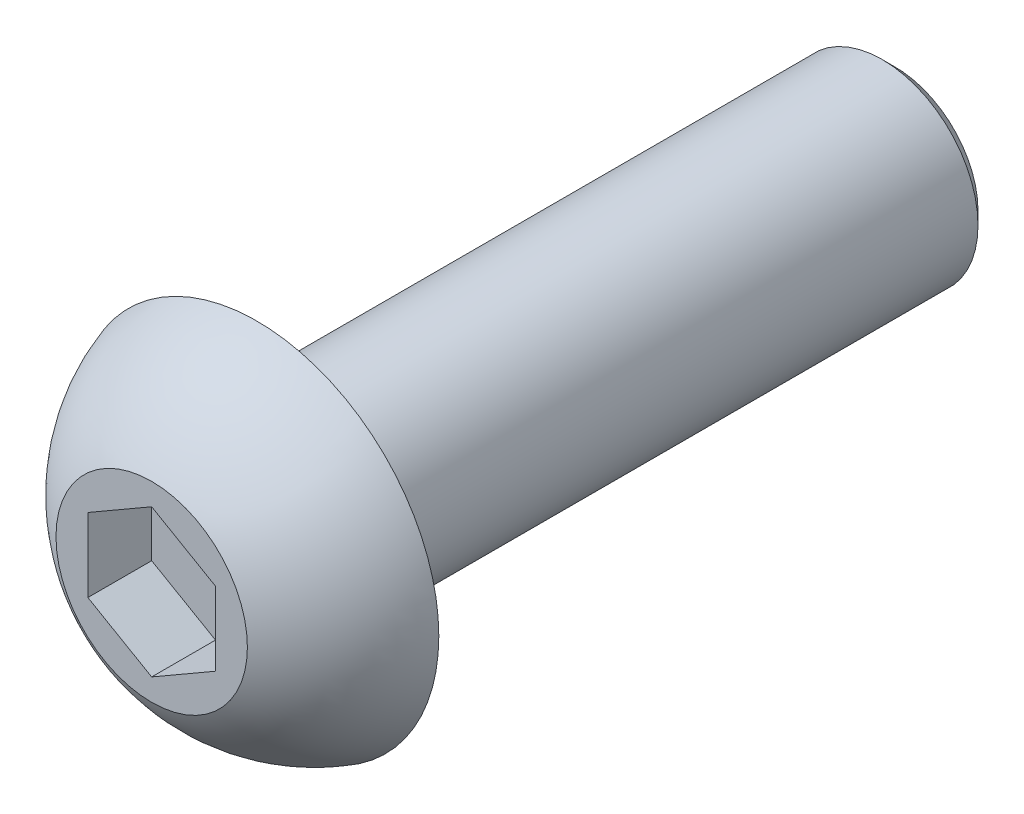
ISO-10303-21;
HEADER;
FILE_DESCRIPTION(('STEP AP214'),'2;1');
FILE_NAME('part.step','',(''),(''),'','','');
FILE_SCHEMA(('AUTOMOTIVE_DESIGN { 1 0 10303 214 1 1 1 1 }'));
ENDSEC;
DATA;
#1=APPLICATION_CONTEXT('core data for automotive mechanical design processes');
#2=APPLICATION_PROTOCOL_DEFINITION('international standard','automotive_design',2000,#1);
#3=PRODUCT_CONTEXT('',#1,'mechanical');
#4=PRODUCT('Part','Part','',(#3));
#5=PRODUCT_RELATED_PRODUCT_CATEGORY('part','',(#4));
#6=PRODUCT_DEFINITION_FORMATION('','',#4);
#7=PRODUCT_DEFINITION_CONTEXT('part definition',#1,'design');
#8=PRODUCT_DEFINITION('design','',#6,#7);
#9=PRODUCT_DEFINITION_SHAPE('','',#8);
#10=(LENGTH_UNIT() NAMED_UNIT(*) SI_UNIT(.MILLI.,.METRE.));
#11=(NAMED_UNIT(*) PLANE_ANGLE_UNIT() SI_UNIT($,.RADIAN.));
#12=(NAMED_UNIT(*) SI_UNIT($,.STERADIAN.) SOLID_ANGLE_UNIT());
#13=UNCERTAINTY_MEASURE_WITH_UNIT(LENGTH_MEASURE(1.E-05),#10,'distance_accuracy_value','');
#14=(GEOMETRIC_REPRESENTATION_CONTEXT(3) GLOBAL_UNCERTAINTY_ASSIGNED_CONTEXT((#13)) GLOBAL_UNIT_ASSIGNED_CONTEXT((#10,
#11,#12)) REPRESENTATION_CONTEXT('',''));
#15=CARTESIAN_POINT('',(0.,0.,0.));
#16=DIRECTION('',(0.,0.,1.));
#17=DIRECTION('',(1.,0.,0.));
#18=AXIS2_PLACEMENT_3D('',#15,#16,#17);
#19=CARTESIAN_POINT('',(0.,0.,-0.848743432909573));
#20=DIRECTION('',(0.,0.,1.));
#21=DIRECTION('',(1.,0.,0.));
#22=AXIS2_PLACEMENT_3D('',#19,#20,#21);
#23=DEGENERATE_TOROIDAL_SURFACE('',#22,0.129313581999413,2.85,.T.);
#24=CARTESIAN_POINT('',(0.,0.,1.65));
#25=DIRECTION('',(0.,0.,1.));
#26=DIRECTION('',(1.,0.,0.));
#27=AXIS2_PLACEMENT_3D('',#24,#25,#26);
#28=CIRCLE('',#27,1.5);
#29=CARTESIAN_POINT('',(1.5,0.,1.65));
#30=VERTEX_POINT('',#29);
#31=EDGE_CURVE('E147',#30,#30,#28,.T.);
#32=ORIENTED_EDGE('',*,*,#31,.F.);
#33=EDGE_LOOP('',(#32));
#34=FACE_BOUND('',#33,.T.);
#35=CARTESIAN_POINT('',(0.,0.,0.));
#36=DIRECTION('',(0.,0.,1.));
#37=DIRECTION('',(1.,0.,0.));
#38=AXIS2_PLACEMENT_3D('',#35,#36,#37);
#39=CIRCLE('',#38,2.85);
#40=CARTESIAN_POINT('',(2.85,0.,0.));
#41=VERTEX_POINT('',#40);
#42=EDGE_CURVE('E136',#41,#41,#39,.T.);
#43=ORIENTED_EDGE('',*,*,#42,.T.);
#44=EDGE_LOOP('',(#43));
#45=FACE_BOUND('',#44,.T.);
#46=ADVANCED_FACE('F34',(#34,#45),#23,.T.);
#47=CARTESIAN_POINT('',(0.,0.,1.65));
#48=DIRECTION('',(0.,0.,-1.));
#49=DIRECTION('',(-1.,0.,0.));
#50=AXIS2_PLACEMENT_3D('',#47,#48,#49);
#51=PLANE('',#50);
#52=DIRECTION('',(-0.866025403784439,-0.5,0.));
#53=VECTOR('',#52,1.);
#54=CARTESIAN_POINT('',(0.,1.15470053837925,1.65));
#55=LINE('',#54,#53);
#56=CARTESIAN_POINT('',(0.,1.15470053837925,1.65));
#57=VERTEX_POINT('',#56);
#58=CARTESIAN_POINT('',(-1.,0.577350269189626,1.65));
#59=VERTEX_POINT('',#58);
#60=EDGE_CURVE('E123',#57,#59,#55,.T.);
#61=ORIENTED_EDGE('',*,*,#60,.F.);
#62=DIRECTION('',(-0.866025403784439,0.5,0.));
#63=VECTOR('',#62,1.);
#64=CARTESIAN_POINT('',(1.,0.577350269189626,1.65));
#65=LINE('',#64,#63);
#66=CARTESIAN_POINT('',(1.,0.577350269189626,1.65));
#67=VERTEX_POINT('',#66);
#68=EDGE_CURVE('E49',#67,#57,#65,.T.);
#69=ORIENTED_EDGE('',*,*,#68,.F.);
#70=DIRECTION('',(0.,1.,0.));
#71=VECTOR('',#70,1.);
#72=CARTESIAN_POINT('',(1.,-0.577350269189626,1.65));
#73=LINE('',#72,#71);
#74=CARTESIAN_POINT('',(1.,-0.577350269189626,1.65));
#75=VERTEX_POINT('',#74);
#76=EDGE_CURVE('E132',#75,#67,#73,.T.);
#77=ORIENTED_EDGE('',*,*,#76,.F.);
#78=DIRECTION('',(0.866025403784439,0.5,0.));
#79=VECTOR('',#78,1.);
#80=CARTESIAN_POINT('',(0.,-1.15470053837925,1.65));
#81=LINE('',#80,#79);
#82=CARTESIAN_POINT('',(0.,-1.15470053837925,1.65));
#83=VERTEX_POINT('',#82);
#84=EDGE_CURVE('E130',#83,#75,#81,.T.);
#85=ORIENTED_EDGE('',*,*,#84,.F.);
#86=DIRECTION('',(0.866025403784439,-0.5,0.));
#87=VECTOR('',#86,1.);
#88=CARTESIAN_POINT('',(-1.,-0.577350269189626,1.65));
#89=LINE('',#88,#87);
#90=CARTESIAN_POINT('',(-1.,-0.577350269189626,1.65));
#91=VERTEX_POINT('',#90);
#92=EDGE_CURVE('E97',#91,#83,#89,.T.);
#93=ORIENTED_EDGE('',*,*,#92,.F.);
#94=DIRECTION('',(0.,-1.,0.));
#95=VECTOR('',#94,1.);
#96=CARTESIAN_POINT('',(-1.,0.577350269189626,1.65));
#97=LINE('',#96,#95);
#98=EDGE_CURVE('E126',#59,#91,#97,.T.);
#99=ORIENTED_EDGE('',*,*,#98,.F.);
#100=EDGE_LOOP('',(#61,#69,#77,#85,#93,#99));
#101=FACE_BOUND('',#100,.T.);
#102=ORIENTED_EDGE('',*,*,#31,.T.);
#103=EDGE_LOOP('',(#102));
#104=FACE_BOUND('',#103,.T.);
#105=ADVANCED_FACE('F164',(#101,#104),#51,.F.);
#106=CARTESIAN_POINT('',(0.,1.5,-10.));
#107=DIRECTION('',(0.,0.,1.));
#108=DIRECTION('',(1.,0.,0.));
#109=AXIS2_PLACEMENT_3D('',#106,#107,#108);
#110=PLANE('',#109);
#111=CARTESIAN_POINT('',(0.,0.,-10.));
#112=DIRECTION('',(0.,0.,1.));
#113=DIRECTION('',(1.,0.,0.));
#114=AXIS2_PLACEMENT_3D('',#111,#112,#113);
#115=CIRCLE('',#114,1.3);
#116=CARTESIAN_POINT('',(1.3,0.,-10.));
#117=VERTEX_POINT('',#116);
#118=EDGE_CURVE('E11',#117,#117,#115,.F.);
#119=ORIENTED_EDGE('',*,*,#118,.T.);
#120=EDGE_LOOP('',(#119));
#121=FACE_BOUND('',#120,.T.);
#122=ADVANCED_FACE('F169',(#121),#110,.F.);
#123=CARTESIAN_POINT('',(0.,0.,-10.));
#124=DIRECTION('',(0.,0.,1.));
#125=DIRECTION('',(1.,0.,0.));
#126=AXIS2_PLACEMENT_3D('',#123,#124,#125);
#127=CYLINDRICAL_SURFACE('',#126,1.5);
#128=CARTESIAN_POINT('',(0.,0.,-9.8));
#129=DIRECTION('',(0.,0.,1.));
#130=DIRECTION('',(1.,0.,0.));
#131=AXIS2_PLACEMENT_3D('',#128,#129,#130);
#132=CIRCLE('',#131,1.5);
#133=CARTESIAN_POINT('',(1.5,0.,-9.8));
#134=VERTEX_POINT('',#133);
#135=EDGE_CURVE('E42',#134,#134,#132,.T.);
#136=ORIENTED_EDGE('',*,*,#135,.T.);
#137=EDGE_LOOP('',(#136));
#138=FACE_BOUND('',#137,.T.);
#139=CARTESIAN_POINT('',(0.,0.,0.));
#140=DIRECTION('',(0.,0.,1.));
#141=DIRECTION('',(1.,0.,0.));
#142=AXIS2_PLACEMENT_3D('',#139,#140,#141);
#143=CIRCLE('',#142,1.5);
#144=CARTESIAN_POINT('',(1.5,0.,0.));
#145=VERTEX_POINT('',#144);
#146=EDGE_CURVE('E144',#145,#145,#143,.T.);
#147=ORIENTED_EDGE('',*,*,#146,.F.);
#148=EDGE_LOOP('',(#147));
#149=FACE_BOUND('',#148,.T.);
#150=ADVANCED_FACE('F152',(#138,#149),#127,.T.);
#151=CARTESIAN_POINT('',(0.,2.85,0.));
#152=DIRECTION('',(0.,0.,1.));
#153=DIRECTION('',(1.,0.,0.));
#154=AXIS2_PLACEMENT_3D('',#151,#152,#153);
#155=PLANE('',#154);
#156=ORIENTED_EDGE('',*,*,#42,.F.);
#157=EDGE_LOOP('',(#156));
#158=FACE_BOUND('',#157,.T.);
#159=ORIENTED_EDGE('',*,*,#146,.T.);
#160=EDGE_LOOP('',(#159));
#161=FACE_BOUND('',#160,.T.);
#162=ADVANCED_FACE('F180',(#158,#161),#155,.F.);
#163=CARTESIAN_POINT('',(1.,0.577350269189626,0.65));
#164=DIRECTION('',(0.5,0.866025403784439,0.));
#165=DIRECTION('',(-0.866025403784439,0.5,0.));
#166=AXIS2_PLACEMENT_3D('',#163,#164,#165);
#167=PLANE('',#166);
#168=ORIENTED_EDGE('',*,*,#68,.T.);
#169=DIRECTION('',(0.,0.,1.));
#170=VECTOR('',#169,1.);
#171=CARTESIAN_POINT('',(0.,1.15470053837925,0.65));
#172=LINE('',#171,#170);
#173=CARTESIAN_POINT('',(0.,1.15470053837925,0.65));
#174=VERTEX_POINT('',#173);
#175=EDGE_CURVE('E79',#174,#57,#172,.T.);
#176=ORIENTED_EDGE('',*,*,#175,.F.);
#177=DIRECTION('',(-0.866025403784439,0.5,0.));
#178=VECTOR('',#177,1.);
#179=CARTESIAN_POINT('',(1.,0.577350269189626,0.65));
#180=LINE('',#179,#178);
#181=CARTESIAN_POINT('',(1.,0.577350269189626,0.65));
#182=VERTEX_POINT('',#181);
#183=EDGE_CURVE('E134',#182,#174,#180,.T.);
#184=ORIENTED_EDGE('',*,*,#183,.F.);
#185=DIRECTION('',(0.,0.,1.));
#186=VECTOR('',#185,1.);
#187=CARTESIAN_POINT('',(1.,0.577350269189626,0.65));
#188=LINE('',#187,#186);
#189=EDGE_CURVE('E57',#182,#67,#188,.T.);
#190=ORIENTED_EDGE('',*,*,#189,.T.);
#191=EDGE_LOOP('',(#168,#176,#184,#190));
#192=FACE_BOUND('',#191,.T.);
#193=ADVANCED_FACE('F183',(#192),#167,.F.);
#194=CARTESIAN_POINT('',(1.,-0.577350269189626,0.65));
#195=DIRECTION('',(1.,0.,0.));
#196=DIRECTION('',(0.,1.,0.));
#197=AXIS2_PLACEMENT_3D('',#194,#195,#196);
#198=PLANE('',#197);
#199=ORIENTED_EDGE('',*,*,#76,.T.);
#200=ORIENTED_EDGE('',*,*,#189,.F.);
#201=DIRECTION('',(0.,1.,0.));
#202=VECTOR('',#201,1.);
#203=CARTESIAN_POINT('',(1.,-0.577350269189626,0.65));
#204=LINE('',#203,#202);
#205=CARTESIAN_POINT('',(1.,-0.577350269189626,0.65));
#206=VERTEX_POINT('',#205);
#207=EDGE_CURVE('E109',#206,#182,#204,.T.);
#208=ORIENTED_EDGE('',*,*,#207,.F.);
#209=DIRECTION('',(0.,0.,1.));
#210=VECTOR('',#209,1.);
#211=CARTESIAN_POINT('',(1.,-0.577350269189626,0.65));
#212=LINE('',#211,#210);
#213=EDGE_CURVE('E101',#206,#75,#212,.T.);
#214=ORIENTED_EDGE('',*,*,#213,.T.);
#215=EDGE_LOOP('',(#199,#200,#208,#214));
#216=FACE_BOUND('',#215,.T.);
#217=ADVANCED_FACE('F187',(#216),#198,.F.);
#218=CARTESIAN_POINT('',(0.,-1.15470053837925,0.65));
#219=DIRECTION('',(0.5,-0.866025403784439,0.));
#220=DIRECTION('',(0.866025403784439,0.5,0.));
#221=AXIS2_PLACEMENT_3D('',#218,#219,#220);
#222=PLANE('',#221);
#223=ORIENTED_EDGE('',*,*,#84,.T.);
#224=ORIENTED_EDGE('',*,*,#213,.F.);
#225=DIRECTION('',(0.866025403784439,0.5,0.));
#226=VECTOR('',#225,1.);
#227=CARTESIAN_POINT('',(0.,-1.15470053837925,0.65));
#228=LINE('',#227,#226);
#229=CARTESIAN_POINT('',(0.,-1.15470053837925,0.65));
#230=VERTEX_POINT('',#229);
#231=EDGE_CURVE('E105',#230,#206,#228,.T.);
#232=ORIENTED_EDGE('',*,*,#231,.F.);
#233=DIRECTION('',(0.,0.,1.));
#234=VECTOR('',#233,1.);
#235=CARTESIAN_POINT('',(0.,-1.15470053837925,0.65));
#236=LINE('',#235,#234);
#237=EDGE_CURVE('E90',#230,#83,#236,.T.);
#238=ORIENTED_EDGE('',*,*,#237,.T.);
#239=EDGE_LOOP('',(#223,#224,#232,#238));
#240=FACE_BOUND('',#239,.T.);
#241=ADVANCED_FACE('F106',(#240),#222,.F.);
#242=CARTESIAN_POINT('',(-1.,-0.577350269189626,0.65));
#243=DIRECTION('',(-0.5,-0.866025403784439,0.));
#244=DIRECTION('',(0.866025403784439,-0.5,0.));
#245=AXIS2_PLACEMENT_3D('',#242,#243,#244);
#246=PLANE('',#245);
#247=ORIENTED_EDGE('',*,*,#92,.T.);
#248=ORIENTED_EDGE('',*,*,#237,.F.);
#249=DIRECTION('',(0.866025403784439,-0.5,0.));
#250=VECTOR('',#249,1.);
#251=CARTESIAN_POINT('',(-1.,-0.577350269189626,0.65));
#252=LINE('',#251,#250);
#253=CARTESIAN_POINT('',(-1.,-0.577350269189626,0.65));
#254=VERTEX_POINT('',#253);
#255=EDGE_CURVE('E94',#254,#230,#252,.T.);
#256=ORIENTED_EDGE('',*,*,#255,.F.);
#257=DIRECTION('',(0.,0.,1.));
#258=VECTOR('',#257,1.);
#259=CARTESIAN_POINT('',(-1.,-0.577350269189626,0.65));
#260=LINE('',#259,#258);
#261=EDGE_CURVE('E102',#254,#91,#260,.T.);
#262=ORIENTED_EDGE('',*,*,#261,.T.);
#263=EDGE_LOOP('',(#247,#248,#256,#262));
#264=FACE_BOUND('',#263,.T.);
#265=ADVANCED_FACE('F92',(#264),#246,.F.);
#266=CARTESIAN_POINT('',(-1.,0.577350269189626,0.65));
#267=DIRECTION('',(-1.,0.,0.));
#268=DIRECTION('',(0.,0.,1.));
#269=AXIS2_PLACEMENT_3D('',#266,#267,#268);
#270=PLANE('',#269);
#271=ORIENTED_EDGE('',*,*,#98,.T.);
#272=ORIENTED_EDGE('',*,*,#261,.F.);
#273=DIRECTION('',(0.,-1.,0.));
#274=VECTOR('',#273,1.);
#275=CARTESIAN_POINT('',(-1.,0.577350269189626,0.65));
#276=LINE('',#275,#274);
#277=CARTESIAN_POINT('',(-1.,0.577350269189626,0.65));
#278=VERTEX_POINT('',#277);
#279=EDGE_CURVE('E115',#278,#254,#276,.T.);
#280=ORIENTED_EDGE('',*,*,#279,.F.);
#281=DIRECTION('',(0.,0.,1.));
#282=VECTOR('',#281,1.);
#283=CARTESIAN_POINT('',(-1.,0.577350269189626,0.65));
#284=LINE('',#283,#282);
#285=EDGE_CURVE('E139',#278,#59,#284,.T.);
#286=ORIENTED_EDGE('',*,*,#285,.T.);
#287=EDGE_LOOP('',(#271,#272,#280,#286));
#288=FACE_BOUND('',#287,.T.);
#289=ADVANCED_FACE('F190',(#288),#270,.F.);
#290=CARTESIAN_POINT('',(0.,1.15470053837925,0.65));
#291=DIRECTION('',(-0.5,0.866025403784438,0.));
#292=DIRECTION('',(-0.866025403784439,-0.5,0.));
#293=AXIS2_PLACEMENT_3D('',#290,#291,#292);
#294=PLANE('',#293);
#295=ORIENTED_EDGE('',*,*,#60,.T.);
#296=ORIENTED_EDGE('',*,*,#285,.F.);
#297=DIRECTION('',(-0.866025403784439,-0.5,0.));
#298=VECTOR('',#297,1.);
#299=CARTESIAN_POINT('',(0.,1.15470053837925,0.65));
#300=LINE('',#299,#298);
#301=EDGE_CURVE('E117',#174,#278,#300,.T.);
#302=ORIENTED_EDGE('',*,*,#301,.F.);
#303=ORIENTED_EDGE('',*,*,#175,.T.);
#304=EDGE_LOOP('',(#295,#296,#302,#303));
#305=FACE_BOUND('',#304,.T.);
#306=ADVANCED_FACE('F160',(#305),#294,.F.);
#307=CARTESIAN_POINT('',(0.,0.,0.65));
#308=DIRECTION('',(0.,0.,1.));
#309=DIRECTION('',(1.,0.,0.));
#310=AXIS2_PLACEMENT_3D('',#307,#308,#309);
#311=PLANE('',#310);
#312=ORIENTED_EDGE('',*,*,#183,.T.);
#313=ORIENTED_EDGE('',*,*,#301,.T.);
#314=ORIENTED_EDGE('',*,*,#279,.T.);
#315=ORIENTED_EDGE('',*,*,#255,.T.);
#316=ORIENTED_EDGE('',*,*,#231,.T.);
#317=ORIENTED_EDGE('',*,*,#207,.T.);
#318=EDGE_LOOP('',(#312,#313,#314,#315,#316,#317));
#319=FACE_BOUND('',#318,.T.);
#320=ADVANCED_FACE('F112',(#319),#311,.T.);
#321=CARTESIAN_POINT('',(0.,0.,-9.8));
#322=DIRECTION('',(0.,0.,1.));
#323=DIRECTION('',(1.,0.,0.));
#324=AXIS2_PLACEMENT_3D('',#321,#322,#323);
#325=CONICAL_SURFACE('',#324,1.5,0.78539816339745);
#326=ORIENTED_EDGE('',*,*,#118,.F.);
#327=EDGE_LOOP('',(#326));
#328=FACE_BOUND('',#327,.T.);
#329=ORIENTED_EDGE('',*,*,#135,.F.);
#330=EDGE_LOOP('',(#329));
#331=FACE_BOUND('',#330,.T.);
#332=ADVANCED_FACE('F36',(#328,#331),#325,.T.);
#333=CLOSED_SHELL('',(#46,#105,#122,#150,#162,#193,#217,#241,#265,#289,#306,#320,#332));
#334=MANIFOLD_SOLID_BREP('B2',#333);
#335=ADVANCED_BREP_SHAPE_REPRESENTATION('',(#18,#334),#14);
#336=SHAPE_DEFINITION_REPRESENTATION(#9,#335);
ENDSEC;
END-ISO-10303-21;
